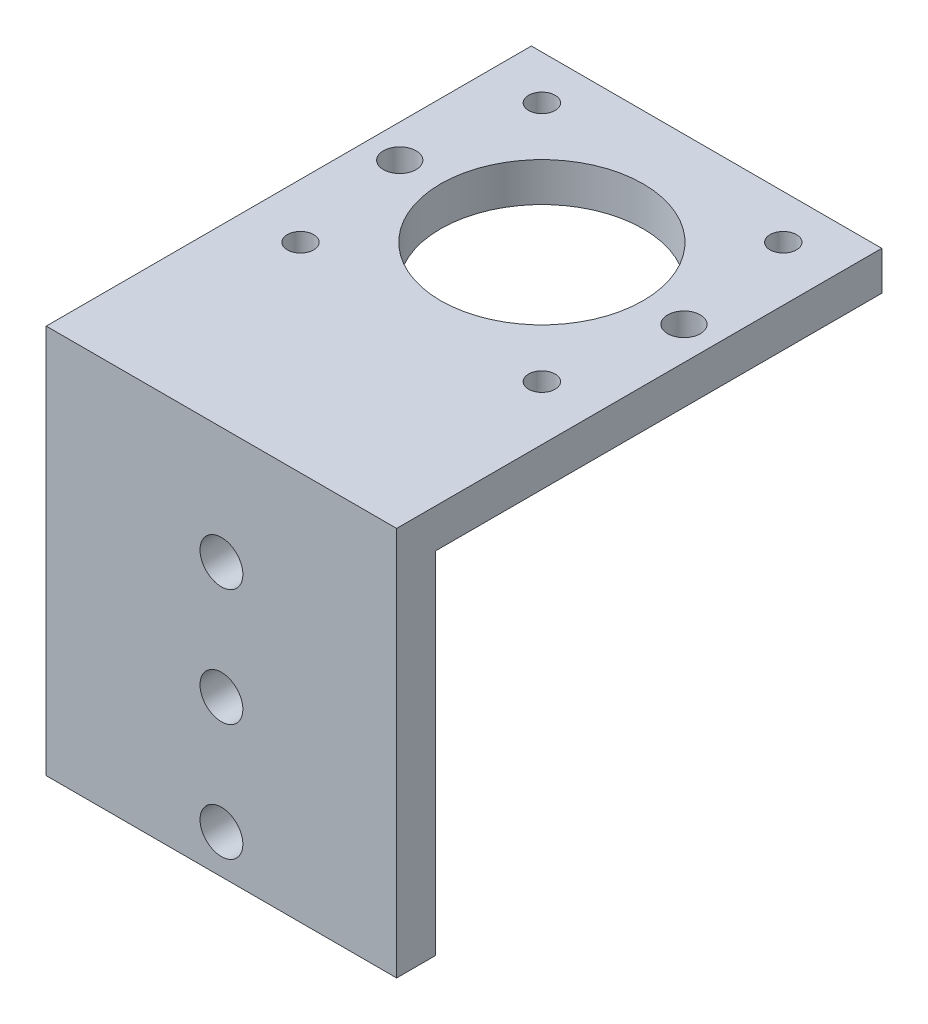
ISO-10303-21;
HEADER;
FILE_DESCRIPTION(('STEP AP214'),'2;1');
FILE_NAME('part.step','',(''),(''),'','','');
FILE_SCHEMA(('AUTOMOTIVE_DESIGN { 1 0 10303 214 1 1 1 1 }'));
ENDSEC;
DATA;
#1=APPLICATION_CONTEXT('core data for automotive mechanical design processes');
#2=APPLICATION_PROTOCOL_DEFINITION('international standard','automotive_design',2000,#1);
#3=PRODUCT_CONTEXT('',#1,'mechanical');
#4=PRODUCT('Part','Part','',(#3));
#5=PRODUCT_RELATED_PRODUCT_CATEGORY('part','',(#4));
#6=PRODUCT_DEFINITION_FORMATION('','',#4);
#7=PRODUCT_DEFINITION_CONTEXT('part definition',#1,'design');
#8=PRODUCT_DEFINITION('design','',#6,#7);
#9=PRODUCT_DEFINITION_SHAPE('','',#8);
#10=(LENGTH_UNIT() NAMED_UNIT(*) SI_UNIT(.MILLI.,.METRE.));
#11=(NAMED_UNIT(*) PLANE_ANGLE_UNIT() SI_UNIT($,.RADIAN.));
#12=(NAMED_UNIT(*) SI_UNIT($,.STERADIAN.) SOLID_ANGLE_UNIT());
#13=UNCERTAINTY_MEASURE_WITH_UNIT(LENGTH_MEASURE(1.E-05),#10,'distance_accuracy_value','');
#14=(GEOMETRIC_REPRESENTATION_CONTEXT(3) GLOBAL_UNCERTAINTY_ASSIGNED_CONTEXT((#13)) GLOBAL_UNIT_ASSIGNED_CONTEXT((#10,
#11,#12)) REPRESENTATION_CONTEXT('',''));
#15=CARTESIAN_POINT('',(0.,0.,0.));
#16=DIRECTION('',(0.,0.,1.));
#17=DIRECTION('',(1.,0.,0.));
#18=AXIS2_PLACEMENT_3D('',#15,#16,#17);
#19=CARTESIAN_POINT('',(0.,5.,0.));
#20=DIRECTION('',(0.,-1.,0.));
#21=DIRECTION('',(0.,0.,-1.));
#22=AXIS2_PLACEMENT_3D('',#19,#20,#21);
#23=PLANE('',#22);
#24=CARTESIAN_POINT('',(-18.25,5.,0.));
#25=DIRECTION('',(0.,1.,0.));
#26=DIRECTION('',(0.,0.,1.));
#27=AXIS2_PLACEMENT_3D('',#24,#25,#26);
#28=CIRCLE('',#27,2.1);
#29=CARTESIAN_POINT('',(-18.25,5.,2.1));
#30=VERTEX_POINT('',#29);
#31=EDGE_CURVE('E378',#30,#30,#28,.T.);
#32=ORIENTED_EDGE('',*,*,#31,.F.);
#33=EDGE_LOOP('',(#32));
#34=FACE_BOUND('',#33,.T.);
#35=CARTESIAN_POINT('',(18.25,5.,0.));
#36=DIRECTION('',(0.,1.,0.));
#37=DIRECTION('',(0.,0.,1.));
#38=AXIS2_PLACEMENT_3D('',#35,#36,#37);
#39=CIRCLE('',#38,2.1);
#40=CARTESIAN_POINT('',(18.25,5.,2.1));
#41=VERTEX_POINT('',#40);
#42=EDGE_CURVE('E174',#41,#41,#39,.T.);
#43=ORIENTED_EDGE('',*,*,#42,.F.);
#44=EDGE_LOOP('',(#43));
#45=FACE_BOUND('',#44,.T.);
#46=CARTESIAN_POINT('',(-15.5,5.,-15.5));
#47=DIRECTION('',(0.,1.,0.));
#48=DIRECTION('',(0.,0.,1.));
#49=AXIS2_PLACEMENT_3D('',#46,#47,#48);
#50=CIRCLE('',#49,1.7);
#51=CARTESIAN_POINT('',(-15.5,5.,-13.8));
#52=VERTEX_POINT('',#51);
#53=EDGE_CURVE('E163',#52,#52,#50,.T.);
#54=ORIENTED_EDGE('',*,*,#53,.F.);
#55=EDGE_LOOP('',(#54));
#56=FACE_BOUND('',#55,.T.);
#57=CARTESIAN_POINT('',(-15.5,5.,15.5));
#58=DIRECTION('',(0.,1.,0.));
#59=DIRECTION('',(0.,0.,1.));
#60=AXIS2_PLACEMENT_3D('',#57,#58,#59);
#61=CIRCLE('',#60,1.7);
#62=CARTESIAN_POINT('',(-15.5,5.,17.2));
#63=VERTEX_POINT('',#62);
#64=EDGE_CURVE('E162',#63,#63,#61,.T.);
#65=ORIENTED_EDGE('',*,*,#64,.F.);
#66=EDGE_LOOP('',(#65));
#67=FACE_BOUND('',#66,.T.);
#68=CARTESIAN_POINT('',(15.5,5.,-15.5));
#69=DIRECTION('',(0.,1.,0.));
#70=DIRECTION('',(0.,0.,1.));
#71=AXIS2_PLACEMENT_3D('',#68,#69,#70);
#72=CIRCLE('',#71,1.7);
#73=CARTESIAN_POINT('',(15.5,5.,-13.8));
#74=VERTEX_POINT('',#73);
#75=EDGE_CURVE('E156',#74,#74,#72,.T.);
#76=ORIENTED_EDGE('',*,*,#75,.F.);
#77=EDGE_LOOP('',(#76));
#78=FACE_BOUND('',#77,.T.);
#79=CARTESIAN_POINT('',(0.,5.,0.));
#80=DIRECTION('',(0.,1.,0.));
#81=DIRECTION('',(0.,0.,1.));
#82=AXIS2_PLACEMENT_3D('',#79,#80,#81);
#83=CIRCLE('',#82,13.);
#84=CARTESIAN_POINT('',(0.,5.,13.));
#85=VERTEX_POINT('',#84);
#86=EDGE_CURVE('E155',#85,#85,#83,.T.);
#87=ORIENTED_EDGE('',*,*,#86,.F.);
#88=EDGE_LOOP('',(#87));
#89=FACE_BOUND('',#88,.T.);
#90=DIRECTION('',(0.,0.,1.));
#91=VECTOR('',#90,1.);
#92=CARTESIAN_POINT('',(-22.5,5.,-21.15));
#93=LINE('',#92,#91);
#94=CARTESIAN_POINT('',(-22.5,5.,-21.15));
#95=VERTEX_POINT('',#94);
#96=CARTESIAN_POINT('',(-22.5,5.,41.15));
#97=VERTEX_POINT('',#96);
#98=EDGE_CURVE('E101',#95,#97,#93,.T.);
#99=ORIENTED_EDGE('',*,*,#98,.T.);
#100=DIRECTION('',(1.,0.,0.));
#101=VECTOR('',#100,1.);
#102=CARTESIAN_POINT('',(-22.5,5.,41.15));
#103=LINE('',#102,#101);
#104=CARTESIAN_POINT('',(22.5,5.,41.15));
#105=VERTEX_POINT('',#104);
#106=EDGE_CURVE('E118',#97,#105,#103,.T.);
#107=ORIENTED_EDGE('',*,*,#106,.T.);
#108=DIRECTION('',(0.,0.,-1.));
#109=VECTOR('',#108,1.);
#110=CARTESIAN_POINT('',(22.5,5.,-21.15));
#111=LINE('',#110,#109);
#112=CARTESIAN_POINT('',(22.5,5.,-21.15));
#113=VERTEX_POINT('',#112);
#114=EDGE_CURVE('E142',#105,#113,#111,.T.);
#115=ORIENTED_EDGE('',*,*,#114,.T.);
#116=DIRECTION('',(-1.,0.,0.));
#117=VECTOR('',#116,1.);
#118=CARTESIAN_POINT('',(22.5,5.,-21.15));
#119=LINE('',#118,#117);
#120=EDGE_CURVE('E58',#113,#95,#119,.T.);
#121=ORIENTED_EDGE('',*,*,#120,.T.);
#122=EDGE_LOOP('',(#99,#107,#115,#121));
#123=FACE_BOUND('',#122,.T.);
#124=CARTESIAN_POINT('',(15.5,5.,15.5));
#125=DIRECTION('',(0.,1.,0.));
#126=DIRECTION('',(0.,0.,1.));
#127=AXIS2_PLACEMENT_3D('',#124,#125,#126);
#128=CIRCLE('',#127,1.7);
#129=CARTESIAN_POINT('',(15.5,5.,17.2));
#130=VERTEX_POINT('',#129);
#131=EDGE_CURVE('E159',#130,#130,#128,.T.);
#132=ORIENTED_EDGE('',*,*,#131,.F.);
#133=EDGE_LOOP('',(#132));
#134=FACE_BOUND('',#133,.T.);
#135=ADVANCED_FACE('F39',(#34,#45,#56,#67,#78,#89,#123,#134),#23,.F.);
#136=CARTESIAN_POINT('',(-22.5,5.,-21.15));
#137=DIRECTION('',(1.,0.,0.));
#138=DIRECTION('',(0.,0.,-1.));
#139=AXIS2_PLACEMENT_3D('',#136,#137,#138);
#140=PLANE('',#139);
#141=DIRECTION('',(0.,0.,1.));
#142=VECTOR('',#141,1.);
#143=CARTESIAN_POINT('',(-22.5,0.,-21.15));
#144=LINE('',#143,#142);
#145=CARTESIAN_POINT('',(-22.5,0.,-21.15));
#146=VERTEX_POINT('',#145);
#147=CARTESIAN_POINT('',(-22.5,0.,36.15));
#148=VERTEX_POINT('',#147);
#149=EDGE_CURVE('E78',#146,#148,#144,.T.);
#150=ORIENTED_EDGE('',*,*,#149,.T.);
#151=DIRECTION('',(0.,1.,0.));
#152=VECTOR('',#151,1.);
#153=CARTESIAN_POINT('',(-22.5,0.,36.15));
#154=LINE('',#153,#152);
#155=CARTESIAN_POINT('',(-22.5,-45.,36.15));
#156=VERTEX_POINT('',#155);
#157=EDGE_CURVE('E123',#156,#148,#154,.T.);
#158=ORIENTED_EDGE('',*,*,#157,.F.);
#159=DIRECTION('',(0.,0.,-1.));
#160=VECTOR('',#159,1.);
#161=CARTESIAN_POINT('',(-22.5,-45.,36.15));
#162=LINE('',#161,#160);
#163=CARTESIAN_POINT('',(-22.5,-45.,41.15));
#164=VERTEX_POINT('',#163);
#165=EDGE_CURVE('E110',#164,#156,#162,.T.);
#166=ORIENTED_EDGE('',*,*,#165,.F.);
#167=DIRECTION('',(0.,-1.,0.));
#168=VECTOR('',#167,1.);
#169=CARTESIAN_POINT('',(-22.5,-45.,41.15));
#170=LINE('',#169,#168);
#171=EDGE_CURVE('E121',#97,#164,#170,.T.);
#172=ORIENTED_EDGE('',*,*,#171,.F.);
#173=ORIENTED_EDGE('',*,*,#98,.F.);
#174=DIRECTION('',(0.,-1.,0.));
#175=VECTOR('',#174,1.);
#176=CARTESIAN_POINT('',(-22.5,5.,-21.15));
#177=LINE('',#176,#175);
#178=EDGE_CURVE('E49',#95,#146,#177,.T.);
#179=ORIENTED_EDGE('',*,*,#178,.T.);
#180=EDGE_LOOP('',(#150,#158,#166,#172,#173,#179));
#181=FACE_BOUND('',#180,.T.);
#182=ADVANCED_FACE('F41',(#181),#140,.F.);
#183=CARTESIAN_POINT('',(22.5,5.,-21.15));
#184=DIRECTION('',(-1.,0.,0.));
#185=DIRECTION('',(0.,0.,1.));
#186=AXIS2_PLACEMENT_3D('',#183,#184,#185);
#187=PLANE('',#186);
#188=DIRECTION('',(0.,0.,-1.));
#189=VECTOR('',#188,1.);
#190=CARTESIAN_POINT('',(22.5,0.,-21.15));
#191=LINE('',#190,#189);
#192=CARTESIAN_POINT('',(22.5,0.,36.15));
#193=VERTEX_POINT('',#192);
#194=CARTESIAN_POINT('',(22.5,0.,-21.15));
#195=VERTEX_POINT('',#194);
#196=EDGE_CURVE('E69',#193,#195,#191,.T.);
#197=ORIENTED_EDGE('',*,*,#196,.T.);
#198=DIRECTION('',(0.,-1.,0.));
#199=VECTOR('',#198,1.);
#200=CARTESIAN_POINT('',(22.5,5.,-21.15));
#201=LINE('',#200,#199);
#202=EDGE_CURVE('E11',#113,#195,#201,.T.);
#203=ORIENTED_EDGE('',*,*,#202,.F.);
#204=ORIENTED_EDGE('',*,*,#114,.F.);
#205=DIRECTION('',(0.,-1.,0.));
#206=VECTOR('',#205,1.);
#207=CARTESIAN_POINT('',(22.5,-45.,41.15));
#208=LINE('',#207,#206);
#209=CARTESIAN_POINT('',(22.5,-45.,41.15));
#210=VERTEX_POINT('',#209);
#211=EDGE_CURVE('E134',#105,#210,#208,.T.);
#212=ORIENTED_EDGE('',*,*,#211,.T.);
#213=DIRECTION('',(0.,0.,-1.));
#214=VECTOR('',#213,1.);
#215=CARTESIAN_POINT('',(22.5,-45.,36.15));
#216=LINE('',#215,#214);
#217=CARTESIAN_POINT('',(22.5,-45.,36.15));
#218=VERTEX_POINT('',#217);
#219=EDGE_CURVE('E112',#210,#218,#216,.T.);
#220=ORIENTED_EDGE('',*,*,#219,.T.);
#221=DIRECTION('',(0.,1.,0.));
#222=VECTOR('',#221,1.);
#223=CARTESIAN_POINT('',(22.5,0.,36.15));
#224=LINE('',#223,#222);
#225=EDGE_CURVE('E126',#218,#193,#224,.T.);
#226=ORIENTED_EDGE('',*,*,#225,.T.);
#227=EDGE_LOOP('',(#197,#203,#204,#212,#220,#226));
#228=FACE_BOUND('',#227,.T.);
#229=ADVANCED_FACE('F229',(#228),#187,.F.);
#230=CARTESIAN_POINT('',(22.5,5.,-21.15));
#231=DIRECTION('',(0.,0.,1.));
#232=DIRECTION('',(1.,0.,0.));
#233=AXIS2_PLACEMENT_3D('',#230,#231,#232);
#234=PLANE('',#233);
#235=DIRECTION('',(-1.,0.,0.));
#236=VECTOR('',#235,1.);
#237=CARTESIAN_POINT('',(22.5,0.,-21.15));
#238=LINE('',#237,#236);
#239=EDGE_CURVE('E143',#195,#146,#238,.T.);
#240=ORIENTED_EDGE('',*,*,#239,.T.);
#241=ORIENTED_EDGE('',*,*,#178,.F.);
#242=ORIENTED_EDGE('',*,*,#120,.F.);
#243=ORIENTED_EDGE('',*,*,#202,.T.);
#244=EDGE_LOOP('',(#240,#241,#242,#243));
#245=FACE_BOUND('',#244,.T.);
#246=ADVANCED_FACE('F238',(#245),#234,.F.);
#247=CARTESIAN_POINT('',(0.,0.,0.));
#248=DIRECTION('',(0.,-1.,0.));
#249=DIRECTION('',(0.,0.,-1.));
#250=AXIS2_PLACEMENT_3D('',#247,#248,#249);
#251=PLANE('',#250);
#252=CARTESIAN_POINT('',(-18.25,0.,0.));
#253=DIRECTION('',(0.,-1.,0.));
#254=DIRECTION('',(0.,0.,-1.));
#255=AXIS2_PLACEMENT_3D('',#252,#253,#254);
#256=CIRCLE('',#255,2.09999999999999);
#257=CARTESIAN_POINT('',(-18.25,0.,-2.09999999999999));
#258=VERTEX_POINT('',#257);
#259=EDGE_CURVE('E376',#258,#258,#256,.T.);
#260=ORIENTED_EDGE('',*,*,#259,.F.);
#261=EDGE_LOOP('',(#260));
#262=FACE_BOUND('',#261,.T.);
#263=CARTESIAN_POINT('',(18.25,0.,0.));
#264=DIRECTION('',(0.,-1.,0.));
#265=DIRECTION('',(0.,0.,-1.));
#266=AXIS2_PLACEMENT_3D('',#263,#264,#265);
#267=CIRCLE('',#266,2.09999999999999);
#268=CARTESIAN_POINT('',(18.25,0.,-2.09999999999999));
#269=VERTEX_POINT('',#268);
#270=EDGE_CURVE('E43',#269,#269,#267,.T.);
#271=ORIENTED_EDGE('',*,*,#270,.F.);
#272=EDGE_LOOP('',(#271));
#273=FACE_BOUND('',#272,.T.);
#274=CARTESIAN_POINT('',(-15.5,0.,-15.5));
#275=DIRECTION('',(0.,-1.,0.));
#276=DIRECTION('',(0.,0.,-1.));
#277=AXIS2_PLACEMENT_3D('',#274,#275,#276);
#278=CIRCLE('',#277,1.69999999999999);
#279=CARTESIAN_POINT('',(-15.5,0.,-17.2));
#280=VERTEX_POINT('',#279);
#281=EDGE_CURVE('E160',#280,#280,#278,.T.);
#282=ORIENTED_EDGE('',*,*,#281,.F.);
#283=EDGE_LOOP('',(#282));
#284=FACE_BOUND('',#283,.T.);
#285=CARTESIAN_POINT('',(-15.5,0.,15.5));
#286=DIRECTION('',(0.,-1.,0.));
#287=DIRECTION('',(0.,0.,-1.));
#288=AXIS2_PLACEMENT_3D('',#285,#286,#287);
#289=CIRCLE('',#288,1.69999999999999);
#290=CARTESIAN_POINT('',(-15.5,0.,13.8));
#291=VERTEX_POINT('',#290);
#292=EDGE_CURVE('E167',#291,#291,#289,.T.);
#293=ORIENTED_EDGE('',*,*,#292,.F.);
#294=EDGE_LOOP('',(#293));
#295=FACE_BOUND('',#294,.T.);
#296=CARTESIAN_POINT('',(15.5,0.,15.5));
#297=DIRECTION('',(0.,-1.,0.));
#298=DIRECTION('',(0.,0.,-1.));
#299=AXIS2_PLACEMENT_3D('',#296,#297,#298);
#300=CIRCLE('',#299,1.69999999999999);
#301=CARTESIAN_POINT('',(15.5,0.,13.8));
#302=VERTEX_POINT('',#301);
#303=EDGE_CURVE('E157',#302,#302,#300,.T.);
#304=ORIENTED_EDGE('',*,*,#303,.F.);
#305=EDGE_LOOP('',(#304));
#306=FACE_BOUND('',#305,.T.);
#307=CARTESIAN_POINT('',(15.5,0.,-15.5));
#308=DIRECTION('',(0.,-1.,0.));
#309=DIRECTION('',(0.,0.,-1.));
#310=AXIS2_PLACEMENT_3D('',#307,#308,#309);
#311=CIRCLE('',#310,1.69999999999999);
#312=CARTESIAN_POINT('',(15.5,0.,-17.2));
#313=VERTEX_POINT('',#312);
#314=EDGE_CURVE('E152',#313,#313,#311,.T.);
#315=ORIENTED_EDGE('',*,*,#314,.F.);
#316=EDGE_LOOP('',(#315));
#317=FACE_BOUND('',#316,.T.);
#318=CARTESIAN_POINT('',(0.,0.,0.));
#319=DIRECTION('',(0.,1.,0.));
#320=DIRECTION('',(0.,0.,1.));
#321=AXIS2_PLACEMENT_3D('',#318,#319,#320);
#322=CIRCLE('',#321,13.);
#323=CARTESIAN_POINT('',(0.,0.,13.));
#324=VERTEX_POINT('',#323);
#325=EDGE_CURVE('E184',#324,#324,#322,.T.);
#326=ORIENTED_EDGE('',*,*,#325,.T.);
#327=EDGE_LOOP('',(#326));
#328=FACE_BOUND('',#327,.T.);
#329=ORIENTED_EDGE('',*,*,#149,.F.);
#330=ORIENTED_EDGE('',*,*,#239,.F.);
#331=ORIENTED_EDGE('',*,*,#196,.F.);
#332=DIRECTION('',(1.,0.,0.));
#333=VECTOR('',#332,1.);
#334=CARTESIAN_POINT('',(-22.5,0.,36.15));
#335=LINE('',#334,#333);
#336=EDGE_CURVE('E137',#148,#193,#335,.T.);
#337=ORIENTED_EDGE('',*,*,#336,.F.);
#338=EDGE_LOOP('',(#329,#330,#331,#337));
#339=FACE_BOUND('',#338,.T.);
#340=ADVANCED_FACE('F234',(#262,#273,#284,#295,#306,#317,#328,#339),#251,.T.);
#341=CARTESIAN_POINT('',(-22.5,0.,36.15));
#342=DIRECTION('',(0.,0.,-1.));
#343=DIRECTION('',(0.,1.,0.));
#344=AXIS2_PLACEMENT_3D('',#341,#342,#343);
#345=PLANE('',#344);
#346=CARTESIAN_POINT('',(0.,-10.,36.15));
#347=DIRECTION('',(0.,0.,-1.));
#348=DIRECTION('',(0.,1.,0.));
#349=AXIS2_PLACEMENT_3D('',#346,#347,#348);
#350=CIRCLE('',#349,2.75);
#351=CARTESIAN_POINT('',(0.,-7.25000000000001,36.15));
#352=VERTEX_POINT('',#351);
#353=EDGE_CURVE('E188',#352,#352,#350,.T.);
#354=ORIENTED_EDGE('',*,*,#353,.F.);
#355=EDGE_LOOP('',(#354));
#356=FACE_BOUND('',#355,.T.);
#357=CARTESIAN_POINT('',(0.,-25.,36.15));
#358=DIRECTION('',(0.,0.,-1.));
#359=DIRECTION('',(0.,1.,0.));
#360=AXIS2_PLACEMENT_3D('',#357,#358,#359);
#361=CIRCLE('',#360,2.75);
#362=CARTESIAN_POINT('',(0.,-22.25,36.15));
#363=VERTEX_POINT('',#362);
#364=EDGE_CURVE('E196',#363,#363,#361,.T.);
#365=ORIENTED_EDGE('',*,*,#364,.F.);
#366=EDGE_LOOP('',(#365));
#367=FACE_BOUND('',#366,.T.);
#368=CARTESIAN_POINT('',(0.,-40.,36.15));
#369=DIRECTION('',(0.,0.,-1.));
#370=DIRECTION('',(0.,1.,0.));
#371=AXIS2_PLACEMENT_3D('',#368,#369,#370);
#372=CIRCLE('',#371,2.75);
#373=CARTESIAN_POINT('',(0.,-37.25,36.15));
#374=VERTEX_POINT('',#373);
#375=EDGE_CURVE('E201',#374,#374,#372,.T.);
#376=ORIENTED_EDGE('',*,*,#375,.F.);
#377=EDGE_LOOP('',(#376));
#378=FACE_BOUND('',#377,.T.);
#379=ORIENTED_EDGE('',*,*,#225,.F.);
#380=DIRECTION('',(1.,0.,0.));
#381=VECTOR('',#380,1.);
#382=CARTESIAN_POINT('',(-22.5,-45.,36.15));
#383=LINE('',#382,#381);
#384=EDGE_CURVE('E117',#156,#218,#383,.T.);
#385=ORIENTED_EDGE('',*,*,#384,.F.);
#386=ORIENTED_EDGE('',*,*,#157,.T.);
#387=ORIENTED_EDGE('',*,*,#336,.T.);
#388=EDGE_LOOP('',(#379,#385,#386,#387));
#389=FACE_BOUND('',#388,.T.);
#390=ADVANCED_FACE('F237',(#356,#367,#378,#389),#345,.T.);
#391=CARTESIAN_POINT('',(-22.5,-45.,36.15));
#392=DIRECTION('',(0.,-1.,0.));
#393=DIRECTION('',(0.,0.,-1.));
#394=AXIS2_PLACEMENT_3D('',#391,#392,#393);
#395=PLANE('',#394);
#396=ORIENTED_EDGE('',*,*,#219,.F.);
#397=DIRECTION('',(1.,0.,0.));
#398=VECTOR('',#397,1.);
#399=CARTESIAN_POINT('',(-22.5,-45.,41.15));
#400=LINE('',#399,#398);
#401=EDGE_CURVE('E107',#164,#210,#400,.T.);
#402=ORIENTED_EDGE('',*,*,#401,.F.);
#403=ORIENTED_EDGE('',*,*,#165,.T.);
#404=ORIENTED_EDGE('',*,*,#384,.T.);
#405=EDGE_LOOP('',(#396,#402,#403,#404));
#406=FACE_BOUND('',#405,.T.);
#407=ADVANCED_FACE('F109',(#406),#395,.T.);
#408=CARTESIAN_POINT('',(-22.5,-45.,41.15));
#409=DIRECTION('',(0.,0.,1.));
#410=DIRECTION('',(1.,0.,0.));
#411=AXIS2_PLACEMENT_3D('',#408,#409,#410);
#412=PLANE('',#411);
#413=CARTESIAN_POINT('',(0.,-10.,41.15));
#414=DIRECTION('',(0.,0.,-1.));
#415=DIRECTION('',(0.,1.,0.));
#416=AXIS2_PLACEMENT_3D('',#413,#414,#415);
#417=CIRCLE('',#416,2.75);
#418=CARTESIAN_POINT('',(0.,-7.25000000000001,41.15));
#419=VERTEX_POINT('',#418);
#420=EDGE_CURVE('E193',#419,#419,#417,.T.);
#421=ORIENTED_EDGE('',*,*,#420,.T.);
#422=EDGE_LOOP('',(#421));
#423=FACE_BOUND('',#422,.T.);
#424=CARTESIAN_POINT('',(0.,-25.,41.15));
#425=DIRECTION('',(0.,0.,-1.));
#426=DIRECTION('',(0.,1.,0.));
#427=AXIS2_PLACEMENT_3D('',#424,#425,#426);
#428=CIRCLE('',#427,2.75);
#429=CARTESIAN_POINT('',(0.,-22.25,41.15));
#430=VERTEX_POINT('',#429);
#431=EDGE_CURVE('E199',#430,#430,#428,.T.);
#432=ORIENTED_EDGE('',*,*,#431,.T.);
#433=EDGE_LOOP('',(#432));
#434=FACE_BOUND('',#433,.T.);
#435=CARTESIAN_POINT('',(0.,-40.,41.15));
#436=DIRECTION('',(0.,0.,-1.));
#437=DIRECTION('',(0.,1.,0.));
#438=AXIS2_PLACEMENT_3D('',#435,#436,#437);
#439=CIRCLE('',#438,2.75);
#440=CARTESIAN_POINT('',(0.,-37.25,41.15));
#441=VERTEX_POINT('',#440);
#442=EDGE_CURVE('E130',#441,#441,#439,.T.);
#443=ORIENTED_EDGE('',*,*,#442,.T.);
#444=EDGE_LOOP('',(#443));
#445=FACE_BOUND('',#444,.T.);
#446=ORIENTED_EDGE('',*,*,#211,.F.);
#447=ORIENTED_EDGE('',*,*,#106,.F.);
#448=ORIENTED_EDGE('',*,*,#171,.T.);
#449=ORIENTED_EDGE('',*,*,#401,.T.);
#450=EDGE_LOOP('',(#446,#447,#448,#449));
#451=FACE_BOUND('',#450,.T.);
#452=ADVANCED_FACE('F125',(#423,#434,#445,#451),#412,.T.);
#453=CARTESIAN_POINT('',(0.,-40.,36.15));
#454=DIRECTION('',(0.,0.,-1.));
#455=DIRECTION('',(0.,1.,0.));
#456=AXIS2_PLACEMENT_3D('',#453,#454,#455);
#457=CYLINDRICAL_SURFACE('',#456,2.75);
#458=ORIENTED_EDGE('',*,*,#442,.F.);
#459=EDGE_LOOP('',(#458));
#460=FACE_BOUND('',#459,.T.);
#461=ORIENTED_EDGE('',*,*,#375,.T.);
#462=EDGE_LOOP('',(#461));
#463=FACE_BOUND('',#462,.T.);
#464=ADVANCED_FACE('F209',(#460,#463),#457,.F.);
#465=CARTESIAN_POINT('',(0.,-25.,36.15));
#466=DIRECTION('',(0.,0.,-1.));
#467=DIRECTION('',(0.,1.,0.));
#468=AXIS2_PLACEMENT_3D('',#465,#466,#467);
#469=CYLINDRICAL_SURFACE('',#468,2.75);
#470=ORIENTED_EDGE('',*,*,#431,.F.);
#471=EDGE_LOOP('',(#470));
#472=FACE_BOUND('',#471,.T.);
#473=ORIENTED_EDGE('',*,*,#364,.T.);
#474=EDGE_LOOP('',(#473));
#475=FACE_BOUND('',#474,.T.);
#476=ADVANCED_FACE('F211',(#472,#475),#469,.F.);
#477=CARTESIAN_POINT('',(0.,-10.,36.15));
#478=DIRECTION('',(0.,0.,-1.));
#479=DIRECTION('',(0.,1.,0.));
#480=AXIS2_PLACEMENT_3D('',#477,#478,#479);
#481=CYLINDRICAL_SURFACE('',#480,2.75);
#482=ORIENTED_EDGE('',*,*,#420,.F.);
#483=EDGE_LOOP('',(#482));
#484=FACE_BOUND('',#483,.T.);
#485=ORIENTED_EDGE('',*,*,#353,.T.);
#486=EDGE_LOOP('',(#485));
#487=FACE_BOUND('',#486,.T.);
#488=ADVANCED_FACE('F217',(#484,#487),#481,.F.);
#489=CARTESIAN_POINT('',(0.,0.,0.));
#490=DIRECTION('',(0.,1.,0.));
#491=DIRECTION('',(0.,0.,1.));
#492=AXIS2_PLACEMENT_3D('',#489,#490,#491);
#493=CYLINDRICAL_SURFACE('',#492,13.);
#494=ORIENTED_EDGE('',*,*,#325,.F.);
#495=EDGE_LOOP('',(#494));
#496=FACE_BOUND('',#495,.T.);
#497=ORIENTED_EDGE('',*,*,#86,.T.);
#498=EDGE_LOOP('',(#497));
#499=FACE_BOUND('',#498,.T.);
#500=ADVANCED_FACE('F290',(#496,#499),#493,.F.);
#501=CARTESIAN_POINT('',(15.5,5.,-15.5));
#502=DIRECTION('',(0.,1.,0.));
#503=DIRECTION('',(0.,0.,1.));
#504=AXIS2_PLACEMENT_3D('',#501,#502,#503);
#505=CYLINDRICAL_SURFACE('',#504,1.69999999999999);
#506=ORIENTED_EDGE('',*,*,#314,.T.);
#507=EDGE_LOOP('',(#506));
#508=FACE_BOUND('',#507,.T.);
#509=ORIENTED_EDGE('',*,*,#75,.T.);
#510=EDGE_LOOP('',(#509));
#511=FACE_BOUND('',#510,.T.);
#512=ADVANCED_FACE('F300',(#508,#511),#505,.F.);
#513=CARTESIAN_POINT('',(15.5,5.,15.5));
#514=DIRECTION('',(0.,1.,0.));
#515=DIRECTION('',(0.,0.,1.));
#516=AXIS2_PLACEMENT_3D('',#513,#514,#515);
#517=CYLINDRICAL_SURFACE('',#516,1.69999999999999);
#518=ORIENTED_EDGE('',*,*,#303,.T.);
#519=EDGE_LOOP('',(#518));
#520=FACE_BOUND('',#519,.T.);
#521=ORIENTED_EDGE('',*,*,#131,.T.);
#522=EDGE_LOOP('',(#521));
#523=FACE_BOUND('',#522,.T.);
#524=ADVANCED_FACE('F311',(#520,#523),#517,.F.);
#525=CARTESIAN_POINT('',(-15.5,5.,15.5));
#526=DIRECTION('',(0.,1.,0.));
#527=DIRECTION('',(0.,0.,1.));
#528=AXIS2_PLACEMENT_3D('',#525,#526,#527);
#529=CYLINDRICAL_SURFACE('',#528,1.69999999999999);
#530=ORIENTED_EDGE('',*,*,#292,.T.);
#531=EDGE_LOOP('',(#530));
#532=FACE_BOUND('',#531,.T.);
#533=ORIENTED_EDGE('',*,*,#64,.T.);
#534=EDGE_LOOP('',(#533));
#535=FACE_BOUND('',#534,.T.);
#536=ADVANCED_FACE('F322',(#532,#535),#529,.F.);
#537=CARTESIAN_POINT('',(-15.5,5.,-15.5));
#538=DIRECTION('',(0.,1.,0.));
#539=DIRECTION('',(0.,0.,1.));
#540=AXIS2_PLACEMENT_3D('',#537,#538,#539);
#541=CYLINDRICAL_SURFACE('',#540,1.69999999999999);
#542=ORIENTED_EDGE('',*,*,#281,.T.);
#543=EDGE_LOOP('',(#542));
#544=FACE_BOUND('',#543,.T.);
#545=ORIENTED_EDGE('',*,*,#53,.T.);
#546=EDGE_LOOP('',(#545));
#547=FACE_BOUND('',#546,.T.);
#548=ADVANCED_FACE('F332',(#544,#547),#541,.F.);
#549=CARTESIAN_POINT('',(18.25,5.,0.));
#550=DIRECTION('',(0.,1.,0.));
#551=DIRECTION('',(0.,0.,1.));
#552=AXIS2_PLACEMENT_3D('',#549,#550,#551);
#553=CYLINDRICAL_SURFACE('',#552,2.09999999999999);
#554=ORIENTED_EDGE('',*,*,#270,.T.);
#555=EDGE_LOOP('',(#554));
#556=FACE_BOUND('',#555,.T.);
#557=ORIENTED_EDGE('',*,*,#42,.T.);
#558=EDGE_LOOP('',(#557));
#559=FACE_BOUND('',#558,.T.);
#560=ADVANCED_FACE('F341',(#556,#559),#553,.F.);
#561=CARTESIAN_POINT('',(-18.25,5.,0.));
#562=DIRECTION('',(0.,1.,0.));
#563=DIRECTION('',(0.,0.,1.));
#564=AXIS2_PLACEMENT_3D('',#561,#562,#563);
#565=CYLINDRICAL_SURFACE('',#564,2.09999999999999);
#566=ORIENTED_EDGE('',*,*,#259,.T.);
#567=EDGE_LOOP('',(#566));
#568=FACE_BOUND('',#567,.T.);
#569=ORIENTED_EDGE('',*,*,#31,.T.);
#570=EDGE_LOOP('',(#569));
#571=FACE_BOUND('',#570,.T.);
#572=ADVANCED_FACE('F356',(#568,#571),#565,.F.);
#573=CLOSED_SHELL('',(#135,#182,#229,#246,#340,#390,#407,#452,#464,#476,#488,#500,#512,#524,
#536,#548,#560,#572));
#574=MANIFOLD_SOLID_BREP('B2',#573);
#575=ADVANCED_BREP_SHAPE_REPRESENTATION('',(#18,#574),#14);
#576=SHAPE_DEFINITION_REPRESENTATION(#9,#575);
ENDSEC;
END-ISO-10303-21;
